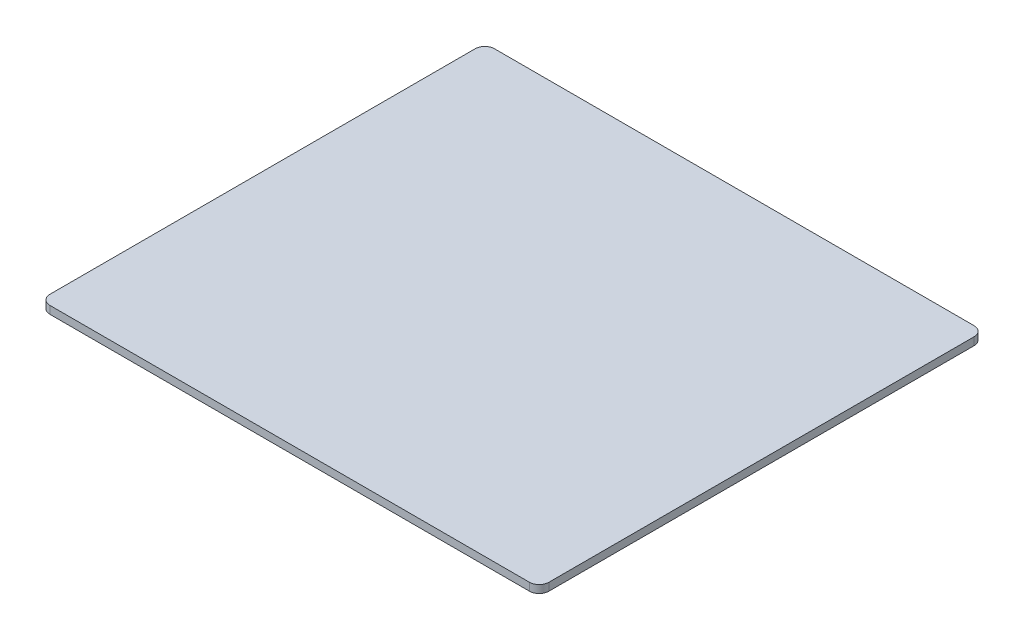
ISO-10303-21;
HEADER;
FILE_DESCRIPTION(('STEP AP214'),'2;1');
FILE_NAME('part.step','',(''),(''),'','','');
FILE_SCHEMA(('AUTOMOTIVE_DESIGN { 1 0 10303 214 1 1 1 1 }'));
ENDSEC;
DATA;
#1=APPLICATION_CONTEXT('core data for automotive mechanical design processes');
#2=APPLICATION_PROTOCOL_DEFINITION('international standard','automotive_design',2000,#1);
#3=PRODUCT_CONTEXT('',#1,'mechanical');
#4=PRODUCT('Part','Part','',(#3));
#5=PRODUCT_RELATED_PRODUCT_CATEGORY('part','',(#4));
#6=PRODUCT_DEFINITION_FORMATION('','',#4);
#7=PRODUCT_DEFINITION_CONTEXT('part definition',#1,'design');
#8=PRODUCT_DEFINITION('design','',#6,#7);
#9=PRODUCT_DEFINITION_SHAPE('','',#8);
#10=(LENGTH_UNIT() NAMED_UNIT(*) SI_UNIT(.MILLI.,.METRE.));
#11=(NAMED_UNIT(*) PLANE_ANGLE_UNIT() SI_UNIT($,.RADIAN.));
#12=(NAMED_UNIT(*) SI_UNIT($,.STERADIAN.) SOLID_ANGLE_UNIT());
#13=UNCERTAINTY_MEASURE_WITH_UNIT(LENGTH_MEASURE(1.E-05),#10,'distance_accuracy_value','');
#14=(GEOMETRIC_REPRESENTATION_CONTEXT(3) GLOBAL_UNCERTAINTY_ASSIGNED_CONTEXT((#13)) GLOBAL_UNIT_ASSIGNED_CONTEXT((#10,
#11,#12)) REPRESENTATION_CONTEXT('',''));
#15=CARTESIAN_POINT('',(0.,0.,0.));
#16=DIRECTION('',(0.,0.,1.));
#17=DIRECTION('',(1.,0.,0.));
#18=AXIS2_PLACEMENT_3D('',#15,#16,#17);
#19=CARTESIAN_POINT('',(0.,0.,0.));
#20=DIRECTION('',(0.,1.,0.));
#21=DIRECTION('',(0.,0.,1.));
#22=AXIS2_PLACEMENT_3D('',#19,#20,#21);
#23=PLANE('',#22);
#24=CARTESIAN_POINT('',(123.5,0.,-109.5));
#25=DIRECTION('',(0.,1.,0.));
#26=DIRECTION('',(0.,0.,1.));
#27=AXIS2_PLACEMENT_3D('',#24,#25,#26);
#28=CIRCLE('',#27,5.);
#29=CARTESIAN_POINT('',(128.5,0.,-109.5));
#30=VERTEX_POINT('',#29);
#31=CARTESIAN_POINT('',(123.5,0.,-114.5));
#32=VERTEX_POINT('',#31);
#33=EDGE_CURVE('E20',#30,#32,#28,.T.);
#34=ORIENTED_EDGE('',*,*,#33,.F.);
#35=DIRECTION('',(0.,0.,1.));
#36=VECTOR('',#35,1.);
#37=CARTESIAN_POINT('',(128.5,0.,114.5));
#38=LINE('',#37,#36);
#39=CARTESIAN_POINT('',(128.5,0.,109.5));
#40=VERTEX_POINT('',#39);
#41=EDGE_CURVE('E78',#30,#40,#38,.T.);
#42=ORIENTED_EDGE('',*,*,#41,.T.);
#43=CARTESIAN_POINT('',(123.5,0.,109.5));
#44=DIRECTION('',(0.,1.,0.));
#45=DIRECTION('',(0.,0.,1.));
#46=AXIS2_PLACEMENT_3D('',#43,#44,#45);
#47=CIRCLE('',#46,5.);
#48=CARTESIAN_POINT('',(123.5,0.,114.5));
#49=VERTEX_POINT('',#48);
#50=EDGE_CURVE('E126',#49,#40,#47,.T.);
#51=ORIENTED_EDGE('',*,*,#50,.F.);
#52=DIRECTION('',(-1.,0.,0.));
#53=VECTOR('',#52,1.);
#54=CARTESIAN_POINT('',(128.5,0.,114.5));
#55=LINE('',#54,#53);
#56=CARTESIAN_POINT('',(-123.5,0.,114.5));
#57=VERTEX_POINT('',#56);
#58=EDGE_CURVE('E109',#49,#57,#55,.T.);
#59=ORIENTED_EDGE('',*,*,#58,.T.);
#60=CARTESIAN_POINT('',(-123.5,0.,109.5));
#61=DIRECTION('',(0.,1.,0.));
#62=DIRECTION('',(0.,0.,1.));
#63=AXIS2_PLACEMENT_3D('',#60,#61,#62);
#64=CIRCLE('',#63,5.);
#65=CARTESIAN_POINT('',(-128.5,0.,109.5));
#66=VERTEX_POINT('',#65);
#67=EDGE_CURVE('E112',#66,#57,#64,.T.);
#68=ORIENTED_EDGE('',*,*,#67,.F.);
#69=DIRECTION('',(0.,0.,-1.));
#70=VECTOR('',#69,1.);
#71=CARTESIAN_POINT('',(-128.5,0.,114.5));
#72=LINE('',#71,#70);
#73=CARTESIAN_POINT('',(-128.5,0.,-109.5));
#74=VERTEX_POINT('',#73);
#75=EDGE_CURVE('E113',#66,#74,#72,.T.);
#76=ORIENTED_EDGE('',*,*,#75,.T.);
#77=CARTESIAN_POINT('',(-123.5,0.,-109.5));
#78=DIRECTION('',(0.,1.,0.));
#79=DIRECTION('',(0.,0.,1.));
#80=AXIS2_PLACEMENT_3D('',#77,#78,#79);
#81=CIRCLE('',#80,5.);
#82=CARTESIAN_POINT('',(-123.5,0.,-114.5));
#83=VERTEX_POINT('',#82);
#84=EDGE_CURVE('E87',#83,#74,#81,.T.);
#85=ORIENTED_EDGE('',*,*,#84,.F.);
#86=DIRECTION('',(1.,0.,0.));
#87=VECTOR('',#86,1.);
#88=CARTESIAN_POINT('',(128.5,0.,-114.5));
#89=LINE('',#88,#87);
#90=EDGE_CURVE('E83',#83,#32,#89,.T.);
#91=ORIENTED_EDGE('',*,*,#90,.T.);
#92=EDGE_LOOP('',(#34,#42,#51,#59,#68,#76,#85,#91));
#93=FACE_BOUND('',#92,.T.);
#94=ADVANCED_FACE('F17',(#93),#23,.F.);
#95=CARTESIAN_POINT('',(128.5,4.,114.5));
#96=DIRECTION('',(-1.,0.,0.));
#97=DIRECTION('',(0.,0.,1.));
#98=AXIS2_PLACEMENT_3D('',#95,#96,#97);
#99=PLANE('',#98);
#100=DIRECTION('',(0.,1.,0.));
#101=VECTOR('',#100,1.);
#102=CARTESIAN_POINT('',(128.5,4.,-109.5));
#103=LINE('',#102,#101);
#104=CARTESIAN_POINT('',(128.5,4.,-109.5));
#105=VERTEX_POINT('',#104);
#106=EDGE_CURVE('E97',#105,#30,#103,.F.);
#107=ORIENTED_EDGE('',*,*,#106,.F.);
#108=DIRECTION('',(0.,0.,1.));
#109=VECTOR('',#108,1.);
#110=CARTESIAN_POINT('',(128.5,4.,0.));
#111=LINE('',#110,#109);
#112=CARTESIAN_POINT('',(128.5,4.,109.5));
#113=VERTEX_POINT('',#112);
#114=EDGE_CURVE('E125',#113,#105,#111,.F.);
#115=ORIENTED_EDGE('',*,*,#114,.F.);
#116=DIRECTION('',(0.,1.,0.));
#117=VECTOR('',#116,1.);
#118=CARTESIAN_POINT('',(128.5,4.,109.5));
#119=LINE('',#118,#117);
#120=EDGE_CURVE('E129',#40,#113,#119,.T.);
#121=ORIENTED_EDGE('',*,*,#120,.F.);
#122=ORIENTED_EDGE('',*,*,#41,.F.);
#123=EDGE_LOOP('',(#107,#115,#121,#122));
#124=FACE_BOUND('',#123,.T.);
#125=ADVANCED_FACE('F163',(#124),#99,.F.);
#126=CARTESIAN_POINT('',(123.5,4.,-109.5));
#127=DIRECTION('',(0.,1.,0.));
#128=DIRECTION('',(0.,0.,1.));
#129=AXIS2_PLACEMENT_3D('',#126,#127,#128);
#130=CYLINDRICAL_SURFACE('',#129,5.);
#131=ORIENTED_EDGE('',*,*,#33,.T.);
#132=DIRECTION('',(0.,1.,0.));
#133=VECTOR('',#132,1.);
#134=CARTESIAN_POINT('',(123.5,4.,-114.5));
#135=LINE('',#134,#133);
#136=CARTESIAN_POINT('',(123.5,4.,-114.5));
#137=VERTEX_POINT('',#136);
#138=EDGE_CURVE('E91',#32,#137,#135,.T.);
#139=ORIENTED_EDGE('',*,*,#138,.T.);
#140=CARTESIAN_POINT('',(123.5,4.,-109.5));
#141=DIRECTION('',(0.,1.,0.));
#142=DIRECTION('',(0.,0.,1.));
#143=AXIS2_PLACEMENT_3D('',#140,#141,#142);
#144=CIRCLE('',#143,5.);
#145=EDGE_CURVE('E123',#105,#137,#144,.T.);
#146=ORIENTED_EDGE('',*,*,#145,.F.);
#147=ORIENTED_EDGE('',*,*,#106,.T.);
#148=EDGE_LOOP('',(#131,#139,#146,#147));
#149=FACE_BOUND('',#148,.T.);
#150=ADVANCED_FACE('F94',(#149),#130,.T.);
#151=CARTESIAN_POINT('',(128.5,4.,-114.5));
#152=DIRECTION('',(0.,0.,1.));
#153=DIRECTION('',(1.,0.,0.));
#154=AXIS2_PLACEMENT_3D('',#151,#152,#153);
#155=PLANE('',#154);
#156=ORIENTED_EDGE('',*,*,#138,.F.);
#157=ORIENTED_EDGE('',*,*,#90,.F.);
#158=DIRECTION('',(0.,1.,0.));
#159=VECTOR('',#158,1.);
#160=CARTESIAN_POINT('',(-123.5,4.,-114.5));
#161=LINE('',#160,#159);
#162=CARTESIAN_POINT('',(-123.5,4.,-114.5));
#163=VERTEX_POINT('',#162);
#164=EDGE_CURVE('E102',#163,#83,#161,.F.);
#165=ORIENTED_EDGE('',*,*,#164,.F.);
#166=DIRECTION('',(1.,0.,0.));
#167=VECTOR('',#166,1.);
#168=CARTESIAN_POINT('',(0.,4.,-114.5));
#169=LINE('',#168,#167);
#170=EDGE_CURVE('E100',#137,#163,#169,.F.);
#171=ORIENTED_EDGE('',*,*,#170,.F.);
#172=EDGE_LOOP('',(#156,#157,#165,#171));
#173=FACE_BOUND('',#172,.T.);
#174=ADVANCED_FACE('F98',(#173),#155,.F.);
#175=CARTESIAN_POINT('',(-123.5,4.,-109.5));
#176=DIRECTION('',(0.,1.,0.));
#177=DIRECTION('',(0.,0.,1.));
#178=AXIS2_PLACEMENT_3D('',#175,#176,#177);
#179=CYLINDRICAL_SURFACE('',#178,5.);
#180=ORIENTED_EDGE('',*,*,#84,.T.);
#181=DIRECTION('',(0.,1.,0.));
#182=VECTOR('',#181,1.);
#183=CARTESIAN_POINT('',(-128.5,4.,-109.5));
#184=LINE('',#183,#182);
#185=CARTESIAN_POINT('',(-128.5,4.,-109.5));
#186=VERTEX_POINT('',#185);
#187=EDGE_CURVE('E114',#74,#186,#184,.T.);
#188=ORIENTED_EDGE('',*,*,#187,.T.);
#189=CARTESIAN_POINT('',(-123.5,4.,-109.5));
#190=DIRECTION('',(0.,1.,0.));
#191=DIRECTION('',(0.,0.,1.));
#192=AXIS2_PLACEMENT_3D('',#189,#190,#191);
#193=CIRCLE('',#192,5.);
#194=EDGE_CURVE('E120',#163,#186,#193,.T.);
#195=ORIENTED_EDGE('',*,*,#194,.F.);
#196=ORIENTED_EDGE('',*,*,#164,.T.);
#197=EDGE_LOOP('',(#180,#188,#195,#196));
#198=FACE_BOUND('',#197,.T.);
#199=ADVANCED_FACE('F134',(#198),#179,.T.);
#200=CARTESIAN_POINT('',(-128.5,4.,114.5));
#201=DIRECTION('',(1.,0.,0.));
#202=DIRECTION('',(0.,0.,-1.));
#203=AXIS2_PLACEMENT_3D('',#200,#201,#202);
#204=PLANE('',#203);
#205=ORIENTED_EDGE('',*,*,#187,.F.);
#206=ORIENTED_EDGE('',*,*,#75,.F.);
#207=DIRECTION('',(0.,1.,0.));
#208=VECTOR('',#207,1.);
#209=CARTESIAN_POINT('',(-128.5,4.,109.5));
#210=LINE('',#209,#208);
#211=CARTESIAN_POINT('',(-128.5,4.,109.5));
#212=VERTEX_POINT('',#211);
#213=EDGE_CURVE('E131',#212,#66,#210,.F.);
#214=ORIENTED_EDGE('',*,*,#213,.F.);
#215=DIRECTION('',(0.,0.,1.));
#216=VECTOR('',#215,1.);
#217=CARTESIAN_POINT('',(-128.5,4.,0.));
#218=LINE('',#217,#216);
#219=EDGE_CURVE('E119',#186,#212,#218,.T.);
#220=ORIENTED_EDGE('',*,*,#219,.F.);
#221=EDGE_LOOP('',(#205,#206,#214,#220));
#222=FACE_BOUND('',#221,.T.);
#223=ADVANCED_FACE('F138',(#222),#204,.F.);
#224=CARTESIAN_POINT('',(-123.5,4.,109.5));
#225=DIRECTION('',(0.,1.,0.));
#226=DIRECTION('',(0.,0.,1.));
#227=AXIS2_PLACEMENT_3D('',#224,#225,#226);
#228=CYLINDRICAL_SURFACE('',#227,5.);
#229=ORIENTED_EDGE('',*,*,#67,.T.);
#230=DIRECTION('',(0.,1.,0.));
#231=VECTOR('',#230,1.);
#232=CARTESIAN_POINT('',(-123.5,4.,114.5));
#233=LINE('',#232,#231);
#234=CARTESIAN_POINT('',(-123.5,4.,114.5));
#235=VERTEX_POINT('',#234);
#236=EDGE_CURVE('E111',#57,#235,#233,.T.);
#237=ORIENTED_EDGE('',*,*,#236,.T.);
#238=CARTESIAN_POINT('',(-123.5,4.,109.5));
#239=DIRECTION('',(0.,1.,0.));
#240=DIRECTION('',(0.,0.,1.));
#241=AXIS2_PLACEMENT_3D('',#238,#239,#240);
#242=CIRCLE('',#241,5.);
#243=EDGE_CURVE('E116',#212,#235,#242,.T.);
#244=ORIENTED_EDGE('',*,*,#243,.F.);
#245=ORIENTED_EDGE('',*,*,#213,.T.);
#246=EDGE_LOOP('',(#229,#237,#244,#245));
#247=FACE_BOUND('',#246,.T.);
#248=ADVANCED_FACE('F160',(#247),#228,.T.);
#249=CARTESIAN_POINT('',(128.5,4.,114.5));
#250=DIRECTION('',(0.,0.,-1.));
#251=DIRECTION('',(-1.,0.,0.));
#252=AXIS2_PLACEMENT_3D('',#249,#250,#251);
#253=PLANE('',#252);
#254=ORIENTED_EDGE('',*,*,#236,.F.);
#255=ORIENTED_EDGE('',*,*,#58,.F.);
#256=DIRECTION('',(0.,1.,0.));
#257=VECTOR('',#256,1.);
#258=CARTESIAN_POINT('',(123.5,4.,114.5));
#259=LINE('',#258,#257);
#260=CARTESIAN_POINT('',(123.5,4.,114.5));
#261=VERTEX_POINT('',#260);
#262=EDGE_CURVE('E35',#261,#49,#259,.F.);
#263=ORIENTED_EDGE('',*,*,#262,.F.);
#264=DIRECTION('',(1.,0.,0.));
#265=VECTOR('',#264,1.);
#266=CARTESIAN_POINT('',(0.,4.,114.5));
#267=LINE('',#266,#265);
#268=EDGE_CURVE('E26',#235,#261,#267,.T.);
#269=ORIENTED_EDGE('',*,*,#268,.F.);
#270=EDGE_LOOP('',(#254,#255,#263,#269));
#271=FACE_BOUND('',#270,.T.);
#272=ADVANCED_FACE('F157',(#271),#253,.F.);
#273=CARTESIAN_POINT('',(123.5,4.,109.5));
#274=DIRECTION('',(0.,1.,0.));
#275=DIRECTION('',(0.,0.,1.));
#276=AXIS2_PLACEMENT_3D('',#273,#274,#275);
#277=CYLINDRICAL_SURFACE('',#276,5.);
#278=ORIENTED_EDGE('',*,*,#50,.T.);
#279=ORIENTED_EDGE('',*,*,#120,.T.);
#280=CARTESIAN_POINT('',(123.5,4.,109.5));
#281=DIRECTION('',(0.,1.,0.));
#282=DIRECTION('',(0.,0.,1.));
#283=AXIS2_PLACEMENT_3D('',#280,#281,#282);
#284=CIRCLE('',#283,5.);
#285=EDGE_CURVE('E10',#261,#113,#284,.T.);
#286=ORIENTED_EDGE('',*,*,#285,.F.);
#287=ORIENTED_EDGE('',*,*,#262,.T.);
#288=EDGE_LOOP('',(#278,#279,#286,#287));
#289=FACE_BOUND('',#288,.T.);
#290=ADVANCED_FACE('F162',(#289),#277,.T.);
#291=CARTESIAN_POINT('',(0.,4.,0.));
#292=DIRECTION('',(0.,1.,0.));
#293=DIRECTION('',(0.,0.,1.));
#294=AXIS2_PLACEMENT_3D('',#291,#292,#293);
#295=PLANE('',#294);
#296=ORIENTED_EDGE('',*,*,#268,.T.);
#297=ORIENTED_EDGE('',*,*,#285,.T.);
#298=ORIENTED_EDGE('',*,*,#114,.T.);
#299=ORIENTED_EDGE('',*,*,#145,.T.);
#300=ORIENTED_EDGE('',*,*,#170,.T.);
#301=ORIENTED_EDGE('',*,*,#194,.T.);
#302=ORIENTED_EDGE('',*,*,#219,.T.);
#303=ORIENTED_EDGE('',*,*,#243,.T.);
#304=EDGE_LOOP('',(#296,#297,#298,#299,#300,#301,#302,#303));
#305=FACE_BOUND('',#304,.T.);
#306=ADVANCED_FACE('F154',(#305),#295,.T.);
#307=CLOSED_SHELL('',(#94,#125,#150,#174,#199,#223,#248,#272,#290,#306));
#308=MANIFOLD_SOLID_BREP('B1',#307);
#309=ADVANCED_BREP_SHAPE_REPRESENTATION('',(#18,#308),#14);
#310=SHAPE_DEFINITION_REPRESENTATION(#9,#309);
ENDSEC;
END-ISO-10303-21;
